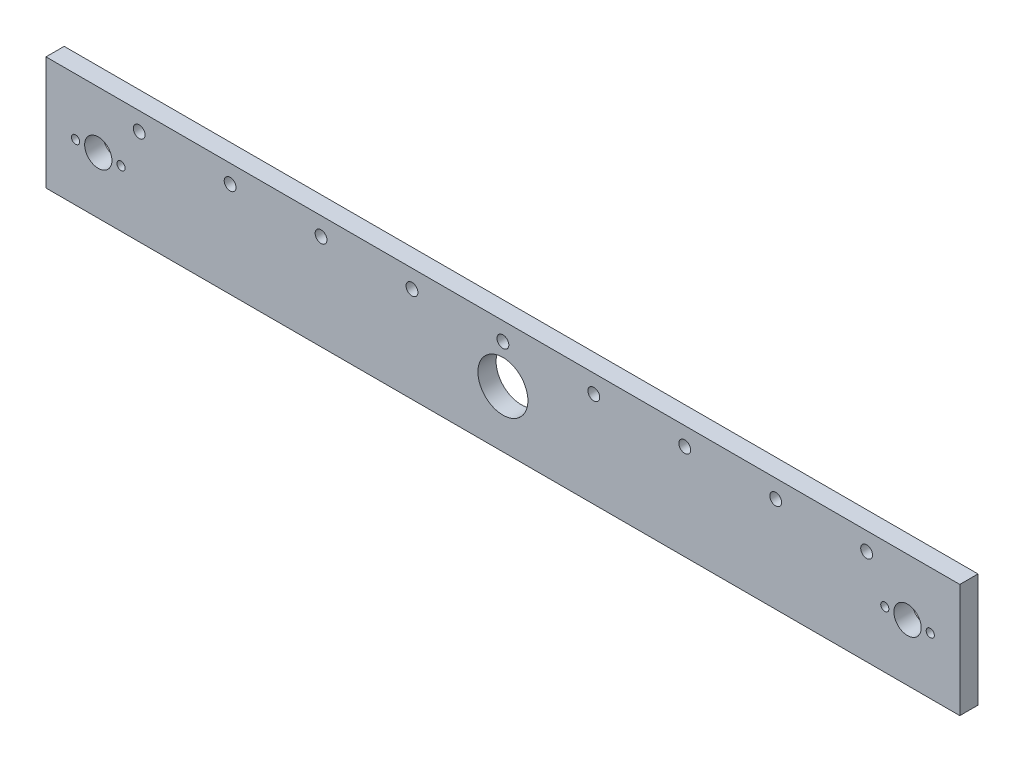
ISO-10303-21;
HEADER;
FILE_DESCRIPTION(('STEP AP214'),'2;1');
FILE_NAME('part.step','',(''),(''),'','','');
FILE_SCHEMA(('AUTOMOTIVE_DESIGN { 1 0 10303 214 1 1 1 1 }'));
ENDSEC;
DATA;
#1=APPLICATION_CONTEXT('core data for automotive mechanical design processes');
#2=APPLICATION_PROTOCOL_DEFINITION('international standard','automotive_design',2000,#1);
#3=PRODUCT_CONTEXT('',#1,'mechanical');
#4=PRODUCT('Part','Part','',(#3));
#5=PRODUCT_RELATED_PRODUCT_CATEGORY('part','',(#4));
#6=PRODUCT_DEFINITION_FORMATION('','',#4);
#7=PRODUCT_DEFINITION_CONTEXT('part definition',#1,'design');
#8=PRODUCT_DEFINITION('design','',#6,#7);
#9=PRODUCT_DEFINITION_SHAPE('','',#8);
#10=(LENGTH_UNIT() NAMED_UNIT(*) SI_UNIT(.MILLI.,.METRE.));
#11=(NAMED_UNIT(*) PLANE_ANGLE_UNIT() SI_UNIT($,.RADIAN.));
#12=(NAMED_UNIT(*) SI_UNIT($,.STERADIAN.) SOLID_ANGLE_UNIT());
#13=UNCERTAINTY_MEASURE_WITH_UNIT(LENGTH_MEASURE(1.E-05),#10,'distance_accuracy_value','');
#14=(GEOMETRIC_REPRESENTATION_CONTEXT(3) GLOBAL_UNCERTAINTY_ASSIGNED_CONTEXT((#13)) GLOBAL_UNIT_ASSIGNED_CONTEXT((#10,
#11,#12)) REPRESENTATION_CONTEXT('',''));
#15=CARTESIAN_POINT('',(0.,0.,0.));
#16=DIRECTION('',(0.,0.,1.));
#17=DIRECTION('',(1.,0.,0.));
#18=AXIS2_PLACEMENT_3D('',#15,#16,#17);
#19=CARTESIAN_POINT('',(0.,0.,8.));
#20=DIRECTION('',(0.,0.,-1.));
#21=DIRECTION('',(-1.,0.,0.));
#22=AXIS2_PLACEMENT_3D('',#19,#20,#21);
#23=PLANE('',#22);
#24=CARTESIAN_POINT('',(120.,17.,8.));
#25=DIRECTION('',(0.,0.,1.));
#26=DIRECTION('',(-1.,0.,0.));
#27=AXIS2_PLACEMENT_3D('',#24,#25,#26);
#28=CIRCLE('',#27,2.6);
#29=CARTESIAN_POINT('',(117.4,17.,8.));
#30=VERTEX_POINT('',#29);
#31=EDGE_CURVE('E193',#30,#30,#28,.T.);
#32=ORIENTED_EDGE('',*,*,#31,.F.);
#33=EDGE_LOOP('',(#32));
#34=FACE_BOUND('',#33,.T.);
#35=CARTESIAN_POINT('',(-160.,17.,8.));
#36=DIRECTION('',(0.,0.,1.));
#37=DIRECTION('',(1.,0.,0.));
#38=AXIS2_PLACEMENT_3D('',#35,#36,#37);
#39=CIRCLE('',#38,2.59999999999999);
#40=CARTESIAN_POINT('',(-157.4,17.,8.));
#41=VERTEX_POINT('',#40);
#42=EDGE_CURVE('E181',#41,#41,#39,.T.);
#43=ORIENTED_EDGE('',*,*,#42,.F.);
#44=EDGE_LOOP('',(#43));
#45=FACE_BOUND('',#44,.T.);
#46=CARTESIAN_POINT('',(-80.,17.,8.));
#47=DIRECTION('',(0.,0.,1.));
#48=DIRECTION('',(1.,0.,0.));
#49=AXIS2_PLACEMENT_3D('',#46,#47,#48);
#50=CIRCLE('',#49,2.6);
#51=CARTESIAN_POINT('',(-77.4,17.,8.));
#52=VERTEX_POINT('',#51);
#53=EDGE_CURVE('E169',#52,#52,#50,.T.);
#54=ORIENTED_EDGE('',*,*,#53,.F.);
#55=EDGE_LOOP('',(#54));
#56=FACE_BOUND('',#55,.T.);
#57=CARTESIAN_POINT('',(40.,17.,8.));
#58=DIRECTION('',(0.,0.,1.));
#59=DIRECTION('',(-1.,0.,0.));
#60=AXIS2_PLACEMENT_3D('',#57,#58,#59);
#61=CIRCLE('',#60,2.6);
#62=CARTESIAN_POINT('',(37.4,17.,8.));
#63=VERTEX_POINT('',#62);
#64=EDGE_CURVE('E157',#63,#63,#61,.T.);
#65=ORIENTED_EDGE('',*,*,#64,.F.);
#66=EDGE_LOOP('',(#65));
#67=FACE_BOUND('',#66,.T.);
#68=CARTESIAN_POINT('',(178.,0.,8.));
#69=DIRECTION('',(0.,0.,1.));
#70=DIRECTION('',(-1.,0.,0.));
#71=AXIS2_PLACEMENT_3D('',#68,#69,#70);
#72=CIRCLE('',#71,6.00000000000002);
#73=CARTESIAN_POINT('',(172.,0.,8.));
#74=VERTEX_POINT('',#73);
#75=EDGE_CURVE('E145',#74,#74,#72,.T.);
#76=ORIENTED_EDGE('',*,*,#75,.F.);
#77=EDGE_LOOP('',(#76));
#78=FACE_BOUND('',#77,.T.);
#79=CARTESIAN_POINT('',(-168.,0.,8.));
#80=DIRECTION('',(0.,0.,1.));
#81=DIRECTION('',(1.,0.,0.));
#82=AXIS2_PLACEMENT_3D('',#79,#80,#81);
#83=CIRCLE('',#82,1.80000000000001);
#84=CARTESIAN_POINT('',(-166.2,0.,8.));
#85=VERTEX_POINT('',#84);
#86=EDGE_CURVE('E133',#85,#85,#83,.T.);
#87=ORIENTED_EDGE('',*,*,#86,.F.);
#88=EDGE_LOOP('',(#87));
#89=FACE_BOUND('',#88,.T.);
#90=CARTESIAN_POINT('',(0.,0.,8.));
#91=DIRECTION('',(0.,0.,1.));
#92=DIRECTION('',(1.,0.,0.));
#93=AXIS2_PLACEMENT_3D('',#90,#91,#92);
#94=CIRCLE('',#93,11.);
#95=CARTESIAN_POINT('',(11.,0.,8.));
#96=VERTEX_POINT('',#95);
#97=EDGE_CURVE('E121',#96,#96,#94,.T.);
#98=ORIENTED_EDGE('',*,*,#97,.F.);
#99=EDGE_LOOP('',(#98));
#100=FACE_BOUND('',#99,.T.);
#101=CARTESIAN_POINT('',(-178.,0.,8.));
#102=DIRECTION('',(0.,0.,1.));
#103=DIRECTION('',(1.,0.,0.));
#104=AXIS2_PLACEMENT_3D('',#101,#102,#103);
#105=CIRCLE('',#104,5.99999999999999);
#106=CARTESIAN_POINT('',(-172.,0.,8.));
#107=VERTEX_POINT('',#106);
#108=EDGE_CURVE('E100',#107,#107,#105,.T.);
#109=ORIENTED_EDGE('',*,*,#108,.F.);
#110=EDGE_LOOP('',(#109));
#111=FACE_BOUND('',#110,.T.);
#112=DIRECTION('',(0.,1.,0.));
#113=VECTOR('',#112,1.);
#114=CARTESIAN_POINT('',(201.,-25.,8.));
#115=LINE('',#114,#113);
#116=CARTESIAN_POINT('',(201.,-25.,8.));
#117=VERTEX_POINT('',#116);
#118=CARTESIAN_POINT('',(201.,25.,8.));
#119=VERTEX_POINT('',#118);
#120=EDGE_CURVE('E85',#117,#119,#115,.T.);
#121=ORIENTED_EDGE('',*,*,#120,.T.);
#122=DIRECTION('',(-1.,0.,0.));
#123=VECTOR('',#122,1.);
#124=CARTESIAN_POINT('',(-201.,25.,8.));
#125=LINE('',#124,#123);
#126=CARTESIAN_POINT('',(-201.,25.,8.));
#127=VERTEX_POINT('',#126);
#128=EDGE_CURVE('E80',#119,#127,#125,.T.);
#129=ORIENTED_EDGE('',*,*,#128,.T.);
#130=DIRECTION('',(0.,-1.,0.));
#131=VECTOR('',#130,1.);
#132=CARTESIAN_POINT('',(-201.,-25.,8.));
#133=LINE('',#132,#131);
#134=CARTESIAN_POINT('',(-201.,-25.,8.));
#135=VERTEX_POINT('',#134);
#136=EDGE_CURVE('E83',#127,#135,#133,.T.);
#137=ORIENTED_EDGE('',*,*,#136,.T.);
#138=DIRECTION('',(1.,0.,0.));
#139=VECTOR('',#138,1.);
#140=CARTESIAN_POINT('',(-201.,-25.,8.));
#141=LINE('',#140,#139);
#142=EDGE_CURVE('E50',#135,#117,#141,.T.);
#143=ORIENTED_EDGE('',*,*,#142,.T.);
#144=EDGE_LOOP('',(#121,#129,#137,#143));
#145=FACE_BOUND('',#144,.T.);
#146=CARTESIAN_POINT('',(168.,0.,8.));
#147=DIRECTION('',(0.,0.,1.));
#148=DIRECTION('',(-1.,0.,0.));
#149=AXIS2_PLACEMENT_3D('',#146,#147,#148);
#150=CIRCLE('',#149,1.80000000000001);
#151=CARTESIAN_POINT('',(166.2,0.,8.));
#152=VERTEX_POINT('',#151);
#153=EDGE_CURVE('E115',#152,#152,#150,.T.);
#154=ORIENTED_EDGE('',*,*,#153,.F.);
#155=EDGE_LOOP('',(#154));
#156=FACE_BOUND('',#155,.T.);
#157=CARTESIAN_POINT('',(-188.,0.,8.));
#158=DIRECTION('',(0.,0.,1.));
#159=DIRECTION('',(1.,0.,0.));
#160=AXIS2_PLACEMENT_3D('',#157,#158,#159);
#161=CIRCLE('',#160,1.80000000000001);
#162=CARTESIAN_POINT('',(-186.2,0.,8.));
#163=VERTEX_POINT('',#162);
#164=EDGE_CURVE('E127',#163,#163,#161,.T.);
#165=ORIENTED_EDGE('',*,*,#164,.F.);
#166=EDGE_LOOP('',(#165));
#167=FACE_BOUND('',#166,.T.);
#168=CARTESIAN_POINT('',(188.,0.,8.));
#169=DIRECTION('',(0.,0.,1.));
#170=DIRECTION('',(-1.,0.,0.));
#171=AXIS2_PLACEMENT_3D('',#168,#169,#170);
#172=CIRCLE('',#171,1.80000000000001);
#173=CARTESIAN_POINT('',(186.2,0.,8.));
#174=VERTEX_POINT('',#173);
#175=EDGE_CURVE('E139',#174,#174,#172,.T.);
#176=ORIENTED_EDGE('',*,*,#175,.F.);
#177=EDGE_LOOP('',(#176));
#178=FACE_BOUND('',#177,.T.);
#179=CARTESIAN_POINT('',(0.,17.,8.));
#180=DIRECTION('',(0.,0.,1.));
#181=DIRECTION('',(1.,0.,0.));
#182=AXIS2_PLACEMENT_3D('',#179,#180,#181);
#183=CIRCLE('',#182,2.6);
#184=CARTESIAN_POINT('',(2.6,17.,8.));
#185=VERTEX_POINT('',#184);
#186=EDGE_CURVE('E151',#185,#185,#183,.T.);
#187=ORIENTED_EDGE('',*,*,#186,.F.);
#188=EDGE_LOOP('',(#187));
#189=FACE_BOUND('',#188,.T.);
#190=CARTESIAN_POINT('',(-40.,17.,8.));
#191=DIRECTION('',(0.,0.,1.));
#192=DIRECTION('',(1.,0.,0.));
#193=AXIS2_PLACEMENT_3D('',#190,#191,#192);
#194=CIRCLE('',#193,2.6);
#195=CARTESIAN_POINT('',(-37.4,17.,8.));
#196=VERTEX_POINT('',#195);
#197=EDGE_CURVE('E163',#196,#196,#194,.T.);
#198=ORIENTED_EDGE('',*,*,#197,.F.);
#199=EDGE_LOOP('',(#198));
#200=FACE_BOUND('',#199,.T.);
#201=CARTESIAN_POINT('',(-120.,17.,8.));
#202=DIRECTION('',(0.,0.,1.));
#203=DIRECTION('',(1.,0.,0.));
#204=AXIS2_PLACEMENT_3D('',#201,#202,#203);
#205=CIRCLE('',#204,2.6);
#206=CARTESIAN_POINT('',(-117.4,17.,8.));
#207=VERTEX_POINT('',#206);
#208=EDGE_CURVE('E175',#207,#207,#205,.T.);
#209=ORIENTED_EDGE('',*,*,#208,.F.);
#210=EDGE_LOOP('',(#209));
#211=FACE_BOUND('',#210,.T.);
#212=CARTESIAN_POINT('',(80.,17.,8.));
#213=DIRECTION('',(0.,0.,1.));
#214=DIRECTION('',(-1.,0.,0.));
#215=AXIS2_PLACEMENT_3D('',#212,#213,#214);
#216=CIRCLE('',#215,2.6);
#217=CARTESIAN_POINT('',(77.4,17.,8.));
#218=VERTEX_POINT('',#217);
#219=EDGE_CURVE('E187',#218,#218,#216,.T.);
#220=ORIENTED_EDGE('',*,*,#219,.F.);
#221=EDGE_LOOP('',(#220));
#222=FACE_BOUND('',#221,.T.);
#223=CARTESIAN_POINT('',(160.,17.,8.));
#224=DIRECTION('',(0.,0.,1.));
#225=DIRECTION('',(-1.,0.,0.));
#226=AXIS2_PLACEMENT_3D('',#223,#224,#225);
#227=CIRCLE('',#226,2.59999999999999);
#228=CARTESIAN_POINT('',(157.4,17.,8.));
#229=VERTEX_POINT('',#228);
#230=EDGE_CURVE('E199',#229,#229,#227,.T.);
#231=ORIENTED_EDGE('',*,*,#230,.F.);
#232=EDGE_LOOP('',(#231));
#233=FACE_BOUND('',#232,.T.);
#234=ADVANCED_FACE('F33',(#34,#45,#56,#67,#78,#89,#100,#111,#145,#156,#167,#178,#189,#200,#211,
#222,#233),#23,.F.);
#235=CARTESIAN_POINT('',(0.,0.,0.));
#236=DIRECTION('',(0.,0.,-1.));
#237=DIRECTION('',(-1.,0.,0.));
#238=AXIS2_PLACEMENT_3D('',#235,#236,#237);
#239=PLANE('',#238);
#240=CARTESIAN_POINT('',(120.,17.,0.));
#241=DIRECTION('',(0.,0.,1.));
#242=DIRECTION('',(-1.,0.,0.));
#243=AXIS2_PLACEMENT_3D('',#240,#241,#242);
#244=CIRCLE('',#243,2.6);
#245=CARTESIAN_POINT('',(117.4,17.,0.));
#246=VERTEX_POINT('',#245);
#247=EDGE_CURVE('E196',#246,#246,#244,.T.);
#248=ORIENTED_EDGE('',*,*,#247,.T.);
#249=EDGE_LOOP('',(#248));
#250=FACE_BOUND('',#249,.T.);
#251=CARTESIAN_POINT('',(-160.,17.,0.));
#252=DIRECTION('',(0.,0.,1.));
#253=DIRECTION('',(1.,0.,0.));
#254=AXIS2_PLACEMENT_3D('',#251,#252,#253);
#255=CIRCLE('',#254,2.59999999999999);
#256=CARTESIAN_POINT('',(-157.4,17.,0.));
#257=VERTEX_POINT('',#256);
#258=EDGE_CURVE('E184',#257,#257,#255,.T.);
#259=ORIENTED_EDGE('',*,*,#258,.T.);
#260=EDGE_LOOP('',(#259));
#261=FACE_BOUND('',#260,.T.);
#262=CARTESIAN_POINT('',(-80.,17.,0.));
#263=DIRECTION('',(0.,0.,1.));
#264=DIRECTION('',(1.,0.,0.));
#265=AXIS2_PLACEMENT_3D('',#262,#263,#264);
#266=CIRCLE('',#265,2.6);
#267=CARTESIAN_POINT('',(-77.4,17.,0.));
#268=VERTEX_POINT('',#267);
#269=EDGE_CURVE('E172',#268,#268,#266,.T.);
#270=ORIENTED_EDGE('',*,*,#269,.T.);
#271=EDGE_LOOP('',(#270));
#272=FACE_BOUND('',#271,.T.);
#273=CARTESIAN_POINT('',(40.,17.,0.));
#274=DIRECTION('',(0.,0.,1.));
#275=DIRECTION('',(-1.,0.,0.));
#276=AXIS2_PLACEMENT_3D('',#273,#274,#275);
#277=CIRCLE('',#276,2.6);
#278=CARTESIAN_POINT('',(37.4,17.,0.));
#279=VERTEX_POINT('',#278);
#280=EDGE_CURVE('E160',#279,#279,#277,.T.);
#281=ORIENTED_EDGE('',*,*,#280,.T.);
#282=EDGE_LOOP('',(#281));
#283=FACE_BOUND('',#282,.T.);
#284=CARTESIAN_POINT('',(178.,0.,0.));
#285=DIRECTION('',(0.,0.,1.));
#286=DIRECTION('',(-1.,0.,0.));
#287=AXIS2_PLACEMENT_3D('',#284,#285,#286);
#288=CIRCLE('',#287,6.00000000000002);
#289=CARTESIAN_POINT('',(172.,0.,0.));
#290=VERTEX_POINT('',#289);
#291=EDGE_CURVE('E148',#290,#290,#288,.T.);
#292=ORIENTED_EDGE('',*,*,#291,.T.);
#293=EDGE_LOOP('',(#292));
#294=FACE_BOUND('',#293,.T.);
#295=CARTESIAN_POINT('',(-168.,0.,0.));
#296=DIRECTION('',(0.,0.,1.));
#297=DIRECTION('',(1.,0.,0.));
#298=AXIS2_PLACEMENT_3D('',#295,#296,#297);
#299=CIRCLE('',#298,1.80000000000001);
#300=CARTESIAN_POINT('',(-166.2,0.,0.));
#301=VERTEX_POINT('',#300);
#302=EDGE_CURVE('E136',#301,#301,#299,.T.);
#303=ORIENTED_EDGE('',*,*,#302,.T.);
#304=EDGE_LOOP('',(#303));
#305=FACE_BOUND('',#304,.T.);
#306=CARTESIAN_POINT('',(0.,0.,0.));
#307=DIRECTION('',(0.,0.,1.));
#308=DIRECTION('',(1.,0.,0.));
#309=AXIS2_PLACEMENT_3D('',#306,#307,#308);
#310=CIRCLE('',#309,11.);
#311=CARTESIAN_POINT('',(11.,0.,0.));
#312=VERTEX_POINT('',#311);
#313=EDGE_CURVE('E124',#312,#312,#310,.T.);
#314=ORIENTED_EDGE('',*,*,#313,.T.);
#315=EDGE_LOOP('',(#314));
#316=FACE_BOUND('',#315,.T.);
#317=CARTESIAN_POINT('',(-178.,0.,0.));
#318=DIRECTION('',(0.,0.,1.));
#319=DIRECTION('',(1.,0.,0.));
#320=AXIS2_PLACEMENT_3D('',#317,#318,#319);
#321=CIRCLE('',#320,5.99999999999999);
#322=CARTESIAN_POINT('',(-172.,0.,0.));
#323=VERTEX_POINT('',#322);
#324=EDGE_CURVE('E112',#323,#323,#321,.T.);
#325=ORIENTED_EDGE('',*,*,#324,.T.);
#326=EDGE_LOOP('',(#325));
#327=FACE_BOUND('',#326,.T.);
#328=DIRECTION('',(0.,1.,0.));
#329=VECTOR('',#328,1.);
#330=CARTESIAN_POINT('',(201.,-25.,0.));
#331=LINE('',#330,#329);
#332=CARTESIAN_POINT('',(201.,-25.,0.));
#333=VERTEX_POINT('',#332);
#334=CARTESIAN_POINT('',(201.,25.,0.));
#335=VERTEX_POINT('',#334);
#336=EDGE_CURVE('E97',#333,#335,#331,.T.);
#337=ORIENTED_EDGE('',*,*,#336,.F.);
#338=DIRECTION('',(1.,0.,0.));
#339=VECTOR('',#338,1.);
#340=CARTESIAN_POINT('',(-201.,-25.,0.));
#341=LINE('',#340,#339);
#342=CARTESIAN_POINT('',(-201.,-25.,0.));
#343=VERTEX_POINT('',#342);
#344=EDGE_CURVE('E73',#343,#333,#341,.T.);
#345=ORIENTED_EDGE('',*,*,#344,.F.);
#346=DIRECTION('',(0.,-1.,0.));
#347=VECTOR('',#346,1.);
#348=CARTESIAN_POINT('',(-201.,-25.,0.));
#349=LINE('',#348,#347);
#350=CARTESIAN_POINT('',(-201.,25.,0.));
#351=VERTEX_POINT('',#350);
#352=EDGE_CURVE('E67',#351,#343,#349,.T.);
#353=ORIENTED_EDGE('',*,*,#352,.F.);
#354=DIRECTION('',(-1.,0.,0.));
#355=VECTOR('',#354,1.);
#356=CARTESIAN_POINT('',(-201.,25.,0.));
#357=LINE('',#356,#355);
#358=EDGE_CURVE('E89',#335,#351,#357,.T.);
#359=ORIENTED_EDGE('',*,*,#358,.F.);
#360=EDGE_LOOP('',(#337,#345,#353,#359));
#361=FACE_BOUND('',#360,.T.);
#362=CARTESIAN_POINT('',(168.,0.,0.));
#363=DIRECTION('',(0.,0.,1.));
#364=DIRECTION('',(-1.,0.,0.));
#365=AXIS2_PLACEMENT_3D('',#362,#363,#364);
#366=CIRCLE('',#365,1.80000000000001);
#367=CARTESIAN_POINT('',(166.2,0.,0.));
#368=VERTEX_POINT('',#367);
#369=EDGE_CURVE('E118',#368,#368,#366,.T.);
#370=ORIENTED_EDGE('',*,*,#369,.T.);
#371=EDGE_LOOP('',(#370));
#372=FACE_BOUND('',#371,.T.);
#373=CARTESIAN_POINT('',(-188.,0.,0.));
#374=DIRECTION('',(0.,0.,1.));
#375=DIRECTION('',(1.,0.,0.));
#376=AXIS2_PLACEMENT_3D('',#373,#374,#375);
#377=CIRCLE('',#376,1.80000000000001);
#378=CARTESIAN_POINT('',(-186.2,0.,0.));
#379=VERTEX_POINT('',#378);
#380=EDGE_CURVE('E130',#379,#379,#377,.T.);
#381=ORIENTED_EDGE('',*,*,#380,.T.);
#382=EDGE_LOOP('',(#381));
#383=FACE_BOUND('',#382,.T.);
#384=CARTESIAN_POINT('',(188.,0.,0.));
#385=DIRECTION('',(0.,0.,1.));
#386=DIRECTION('',(-1.,0.,0.));
#387=AXIS2_PLACEMENT_3D('',#384,#385,#386);
#388=CIRCLE('',#387,1.80000000000001);
#389=CARTESIAN_POINT('',(186.2,0.,0.));
#390=VERTEX_POINT('',#389);
#391=EDGE_CURVE('E142',#390,#390,#388,.T.);
#392=ORIENTED_EDGE('',*,*,#391,.T.);
#393=EDGE_LOOP('',(#392));
#394=FACE_BOUND('',#393,.T.);
#395=CARTESIAN_POINT('',(0.,17.,0.));
#396=DIRECTION('',(0.,0.,1.));
#397=DIRECTION('',(1.,0.,0.));
#398=AXIS2_PLACEMENT_3D('',#395,#396,#397);
#399=CIRCLE('',#398,2.6);
#400=CARTESIAN_POINT('',(2.6,17.,0.));
#401=VERTEX_POINT('',#400);
#402=EDGE_CURVE('E154',#401,#401,#399,.T.);
#403=ORIENTED_EDGE('',*,*,#402,.T.);
#404=EDGE_LOOP('',(#403));
#405=FACE_BOUND('',#404,.T.);
#406=CARTESIAN_POINT('',(-40.,17.,0.));
#407=DIRECTION('',(0.,0.,1.));
#408=DIRECTION('',(1.,0.,0.));
#409=AXIS2_PLACEMENT_3D('',#406,#407,#408);
#410=CIRCLE('',#409,2.6);
#411=CARTESIAN_POINT('',(-37.4,17.,0.));
#412=VERTEX_POINT('',#411);
#413=EDGE_CURVE('E166',#412,#412,#410,.T.);
#414=ORIENTED_EDGE('',*,*,#413,.T.);
#415=EDGE_LOOP('',(#414));
#416=FACE_BOUND('',#415,.T.);
#417=CARTESIAN_POINT('',(-120.,17.,0.));
#418=DIRECTION('',(0.,0.,1.));
#419=DIRECTION('',(1.,0.,0.));
#420=AXIS2_PLACEMENT_3D('',#417,#418,#419);
#421=CIRCLE('',#420,2.6);
#422=CARTESIAN_POINT('',(-117.4,17.,0.));
#423=VERTEX_POINT('',#422);
#424=EDGE_CURVE('E178',#423,#423,#421,.T.);
#425=ORIENTED_EDGE('',*,*,#424,.T.);
#426=EDGE_LOOP('',(#425));
#427=FACE_BOUND('',#426,.T.);
#428=CARTESIAN_POINT('',(80.,17.,0.));
#429=DIRECTION('',(0.,0.,1.));
#430=DIRECTION('',(-1.,0.,0.));
#431=AXIS2_PLACEMENT_3D('',#428,#429,#430);
#432=CIRCLE('',#431,2.6);
#433=CARTESIAN_POINT('',(77.4,17.,0.));
#434=VERTEX_POINT('',#433);
#435=EDGE_CURVE('E190',#434,#434,#432,.T.);
#436=ORIENTED_EDGE('',*,*,#435,.T.);
#437=EDGE_LOOP('',(#436));
#438=FACE_BOUND('',#437,.T.);
#439=CARTESIAN_POINT('',(160.,17.,0.));
#440=DIRECTION('',(0.,0.,1.));
#441=DIRECTION('',(-1.,0.,0.));
#442=AXIS2_PLACEMENT_3D('',#439,#440,#441);
#443=CIRCLE('',#442,2.59999999999999);
#444=CARTESIAN_POINT('',(157.4,17.,0.));
#445=VERTEX_POINT('',#444);
#446=EDGE_CURVE('E202',#445,#445,#443,.T.);
#447=ORIENTED_EDGE('',*,*,#446,.T.);
#448=EDGE_LOOP('',(#447));
#449=FACE_BOUND('',#448,.T.);
#450=ADVANCED_FACE('F108',(#250,#261,#272,#283,#294,#305,#316,#327,#361,#372,#383,#394,#405,
#416,#427,#438,#449),#239,.T.);
#451=CARTESIAN_POINT('',(201.,-25.,8.));
#452=DIRECTION('',(-1.,0.,0.));
#453=DIRECTION('',(0.,0.,1.));
#454=AXIS2_PLACEMENT_3D('',#451,#452,#453);
#455=PLANE('',#454);
#456=ORIENTED_EDGE('',*,*,#336,.T.);
#457=DIRECTION('',(0.,0.,-1.));
#458=VECTOR('',#457,1.);
#459=CARTESIAN_POINT('',(201.,25.,8.));
#460=LINE('',#459,#458);
#461=EDGE_CURVE('E11',#119,#335,#460,.T.);
#462=ORIENTED_EDGE('',*,*,#461,.F.);
#463=ORIENTED_EDGE('',*,*,#120,.F.);
#464=DIRECTION('',(0.,0.,-1.));
#465=VECTOR('',#464,1.);
#466=CARTESIAN_POINT('',(201.,-25.,8.));
#467=LINE('',#466,#465);
#468=EDGE_CURVE('E93',#117,#333,#467,.T.);
#469=ORIENTED_EDGE('',*,*,#468,.T.);
#470=EDGE_LOOP('',(#456,#462,#463,#469));
#471=FACE_BOUND('',#470,.T.);
#472=ADVANCED_FACE('F35',(#471),#455,.F.);
#473=CARTESIAN_POINT('',(-201.,25.,8.));
#474=DIRECTION('',(0.,-1.,0.));
#475=DIRECTION('',(0.,0.,-1.));
#476=AXIS2_PLACEMENT_3D('',#473,#474,#475);
#477=PLANE('',#476);
#478=ORIENTED_EDGE('',*,*,#358,.T.);
#479=DIRECTION('',(0.,0.,-1.));
#480=VECTOR('',#479,1.);
#481=CARTESIAN_POINT('',(-201.,25.,8.));
#482=LINE('',#481,#480);
#483=EDGE_CURVE('E42',#127,#351,#482,.T.);
#484=ORIENTED_EDGE('',*,*,#483,.F.);
#485=ORIENTED_EDGE('',*,*,#128,.F.);
#486=ORIENTED_EDGE('',*,*,#461,.T.);
#487=EDGE_LOOP('',(#478,#484,#485,#486));
#488=FACE_BOUND('',#487,.T.);
#489=ADVANCED_FACE('F88',(#488),#477,.F.);
#490=CARTESIAN_POINT('',(-201.,-25.,8.));
#491=DIRECTION('',(1.,0.,0.));
#492=DIRECTION('',(0.,0.,-1.));
#493=AXIS2_PLACEMENT_3D('',#490,#491,#492);
#494=PLANE('',#493);
#495=ORIENTED_EDGE('',*,*,#352,.T.);
#496=DIRECTION('',(0.,0.,-1.));
#497=VECTOR('',#496,1.);
#498=CARTESIAN_POINT('',(-201.,-25.,8.));
#499=LINE('',#498,#497);
#500=EDGE_CURVE('E90',#135,#343,#499,.T.);
#501=ORIENTED_EDGE('',*,*,#500,.F.);
#502=ORIENTED_EDGE('',*,*,#136,.F.);
#503=ORIENTED_EDGE('',*,*,#483,.T.);
#504=EDGE_LOOP('',(#495,#501,#502,#503));
#505=FACE_BOUND('',#504,.T.);
#506=ADVANCED_FACE('F91',(#505),#494,.F.);
#507=CARTESIAN_POINT('',(-201.,-25.,8.));
#508=DIRECTION('',(0.,1.,0.));
#509=DIRECTION('',(0.,0.,1.));
#510=AXIS2_PLACEMENT_3D('',#507,#508,#509);
#511=PLANE('',#510);
#512=ORIENTED_EDGE('',*,*,#344,.T.);
#513=ORIENTED_EDGE('',*,*,#468,.F.);
#514=ORIENTED_EDGE('',*,*,#142,.F.);
#515=ORIENTED_EDGE('',*,*,#500,.T.);
#516=EDGE_LOOP('',(#512,#513,#514,#515));
#517=FACE_BOUND('',#516,.T.);
#518=ADVANCED_FACE('F105',(#517),#511,.F.);
#519=CARTESIAN_POINT('',(-178.,0.,8.));
#520=DIRECTION('',(0.,0.,-1.));
#521=DIRECTION('',(-1.,0.,0.));
#522=AXIS2_PLACEMENT_3D('',#519,#520,#521);
#523=CYLINDRICAL_SURFACE('',#522,5.99999999999999);
#524=ORIENTED_EDGE('',*,*,#108,.T.);
#525=EDGE_LOOP('',(#524));
#526=FACE_BOUND('',#525,.T.);
#527=ORIENTED_EDGE('',*,*,#324,.F.);
#528=EDGE_LOOP('',(#527));
#529=FACE_BOUND('',#528,.T.);
#530=ADVANCED_FACE('F222',(#526,#529),#523,.F.);
#531=CARTESIAN_POINT('',(168.,0.,8.));
#532=DIRECTION('',(0.,0.,-1.));
#533=DIRECTION('',(-1.,0.,0.));
#534=AXIS2_PLACEMENT_3D('',#531,#532,#533);
#535=CYLINDRICAL_SURFACE('',#534,1.80000000000001);
#536=ORIENTED_EDGE('',*,*,#153,.T.);
#537=EDGE_LOOP('',(#536));
#538=FACE_BOUND('',#537,.T.);
#539=ORIENTED_EDGE('',*,*,#369,.F.);
#540=EDGE_LOOP('',(#539));
#541=FACE_BOUND('',#540,.T.);
#542=ADVANCED_FACE('F268',(#538,#541),#535,.F.);
#543=CARTESIAN_POINT('',(0.,0.,8.));
#544=DIRECTION('',(0.,0.,-1.));
#545=DIRECTION('',(-1.,0.,0.));
#546=AXIS2_PLACEMENT_3D('',#543,#544,#545);
#547=CYLINDRICAL_SURFACE('',#546,11.);
#548=ORIENTED_EDGE('',*,*,#97,.T.);
#549=EDGE_LOOP('',(#548));
#550=FACE_BOUND('',#549,.T.);
#551=ORIENTED_EDGE('',*,*,#313,.F.);
#552=EDGE_LOOP('',(#551));
#553=FACE_BOUND('',#552,.T.);
#554=ADVANCED_FACE('F276',(#550,#553),#547,.F.);
#555=CARTESIAN_POINT('',(-188.,0.,8.));
#556=DIRECTION('',(0.,0.,-1.));
#557=DIRECTION('',(-1.,0.,0.));
#558=AXIS2_PLACEMENT_3D('',#555,#556,#557);
#559=CYLINDRICAL_SURFACE('',#558,1.80000000000001);
#560=ORIENTED_EDGE('',*,*,#164,.T.);
#561=EDGE_LOOP('',(#560));
#562=FACE_BOUND('',#561,.T.);
#563=ORIENTED_EDGE('',*,*,#380,.F.);
#564=EDGE_LOOP('',(#563));
#565=FACE_BOUND('',#564,.T.);
#566=ADVANCED_FACE('F284',(#562,#565),#559,.F.);
#567=CARTESIAN_POINT('',(-168.,0.,8.));
#568=DIRECTION('',(0.,0.,-1.));
#569=DIRECTION('',(-1.,0.,0.));
#570=AXIS2_PLACEMENT_3D('',#567,#568,#569);
#571=CYLINDRICAL_SURFACE('',#570,1.80000000000001);
#572=ORIENTED_EDGE('',*,*,#86,.T.);
#573=EDGE_LOOP('',(#572));
#574=FACE_BOUND('',#573,.T.);
#575=ORIENTED_EDGE('',*,*,#302,.F.);
#576=EDGE_LOOP('',(#575));
#577=FACE_BOUND('',#576,.T.);
#578=ADVANCED_FACE('F293',(#574,#577),#571,.F.);
#579=CARTESIAN_POINT('',(188.,0.,8.));
#580=DIRECTION('',(0.,0.,-1.));
#581=DIRECTION('',(-1.,0.,0.));
#582=AXIS2_PLACEMENT_3D('',#579,#580,#581);
#583=CYLINDRICAL_SURFACE('',#582,1.80000000000001);
#584=ORIENTED_EDGE('',*,*,#175,.T.);
#585=EDGE_LOOP('',(#584));
#586=FACE_BOUND('',#585,.T.);
#587=ORIENTED_EDGE('',*,*,#391,.F.);
#588=EDGE_LOOP('',(#587));
#589=FACE_BOUND('',#588,.T.);
#590=ADVANCED_FACE('F302',(#586,#589),#583,.F.);
#591=CARTESIAN_POINT('',(178.,0.,8.));
#592=DIRECTION('',(0.,0.,-1.));
#593=DIRECTION('',(-1.,0.,0.));
#594=AXIS2_PLACEMENT_3D('',#591,#592,#593);
#595=CYLINDRICAL_SURFACE('',#594,6.00000000000002);
#596=ORIENTED_EDGE('',*,*,#75,.T.);
#597=EDGE_LOOP('',(#596));
#598=FACE_BOUND('',#597,.T.);
#599=ORIENTED_EDGE('',*,*,#291,.F.);
#600=EDGE_LOOP('',(#599));
#601=FACE_BOUND('',#600,.T.);
#602=ADVANCED_FACE('F311',(#598,#601),#595,.F.);
#603=CARTESIAN_POINT('',(0.,17.,8.));
#604=DIRECTION('',(0.,0.,-1.));
#605=DIRECTION('',(-1.,0.,0.));
#606=AXIS2_PLACEMENT_3D('',#603,#604,#605);
#607=CYLINDRICAL_SURFACE('',#606,2.6);
#608=ORIENTED_EDGE('',*,*,#186,.T.);
#609=EDGE_LOOP('',(#608));
#610=FACE_BOUND('',#609,.T.);
#611=ORIENTED_EDGE('',*,*,#402,.F.);
#612=EDGE_LOOP('',(#611));
#613=FACE_BOUND('',#612,.T.);
#614=ADVANCED_FACE('F320',(#610,#613),#607,.F.);
#615=CARTESIAN_POINT('',(40.,17.,8.));
#616=DIRECTION('',(0.,0.,-1.));
#617=DIRECTION('',(-1.,0.,0.));
#618=AXIS2_PLACEMENT_3D('',#615,#616,#617);
#619=CYLINDRICAL_SURFACE('',#618,2.6);
#620=ORIENTED_EDGE('',*,*,#64,.T.);
#621=EDGE_LOOP('',(#620));
#622=FACE_BOUND('',#621,.T.);
#623=ORIENTED_EDGE('',*,*,#280,.F.);
#624=EDGE_LOOP('',(#623));
#625=FACE_BOUND('',#624,.T.);
#626=ADVANCED_FACE('F329',(#622,#625),#619,.F.);
#627=CARTESIAN_POINT('',(-40.,17.,8.));
#628=DIRECTION('',(0.,0.,-1.));
#629=DIRECTION('',(-1.,0.,0.));
#630=AXIS2_PLACEMENT_3D('',#627,#628,#629);
#631=CYLINDRICAL_SURFACE('',#630,2.6);
#632=ORIENTED_EDGE('',*,*,#197,.T.);
#633=EDGE_LOOP('',(#632));
#634=FACE_BOUND('',#633,.T.);
#635=ORIENTED_EDGE('',*,*,#413,.F.);
#636=EDGE_LOOP('',(#635));
#637=FACE_BOUND('',#636,.T.);
#638=ADVANCED_FACE('F338',(#634,#637),#631,.F.);
#639=CARTESIAN_POINT('',(-80.,17.,8.));
#640=DIRECTION('',(0.,0.,-1.));
#641=DIRECTION('',(-1.,0.,0.));
#642=AXIS2_PLACEMENT_3D('',#639,#640,#641);
#643=CYLINDRICAL_SURFACE('',#642,2.6);
#644=ORIENTED_EDGE('',*,*,#53,.T.);
#645=EDGE_LOOP('',(#644));
#646=FACE_BOUND('',#645,.T.);
#647=ORIENTED_EDGE('',*,*,#269,.F.);
#648=EDGE_LOOP('',(#647));
#649=FACE_BOUND('',#648,.T.);
#650=ADVANCED_FACE('F347',(#646,#649),#643,.F.);
#651=CARTESIAN_POINT('',(-120.,17.,8.));
#652=DIRECTION('',(0.,0.,-1.));
#653=DIRECTION('',(-1.,0.,0.));
#654=AXIS2_PLACEMENT_3D('',#651,#652,#653);
#655=CYLINDRICAL_SURFACE('',#654,2.6);
#656=ORIENTED_EDGE('',*,*,#208,.T.);
#657=EDGE_LOOP('',(#656));
#658=FACE_BOUND('',#657,.T.);
#659=ORIENTED_EDGE('',*,*,#424,.F.);
#660=EDGE_LOOP('',(#659));
#661=FACE_BOUND('',#660,.T.);
#662=ADVANCED_FACE('F356',(#658,#661),#655,.F.);
#663=CARTESIAN_POINT('',(-160.,17.,8.));
#664=DIRECTION('',(0.,0.,-1.));
#665=DIRECTION('',(-1.,0.,0.));
#666=AXIS2_PLACEMENT_3D('',#663,#664,#665);
#667=CYLINDRICAL_SURFACE('',#666,2.59999999999999);
#668=ORIENTED_EDGE('',*,*,#42,.T.);
#669=EDGE_LOOP('',(#668));
#670=FACE_BOUND('',#669,.T.);
#671=ORIENTED_EDGE('',*,*,#258,.F.);
#672=EDGE_LOOP('',(#671));
#673=FACE_BOUND('',#672,.T.);
#674=ADVANCED_FACE('F365',(#670,#673),#667,.F.);
#675=CARTESIAN_POINT('',(80.,17.,8.));
#676=DIRECTION('',(0.,0.,-1.));
#677=DIRECTION('',(-1.,0.,0.));
#678=AXIS2_PLACEMENT_3D('',#675,#676,#677);
#679=CYLINDRICAL_SURFACE('',#678,2.6);
#680=ORIENTED_EDGE('',*,*,#219,.T.);
#681=EDGE_LOOP('',(#680));
#682=FACE_BOUND('',#681,.T.);
#683=ORIENTED_EDGE('',*,*,#435,.F.);
#684=EDGE_LOOP('',(#683));
#685=FACE_BOUND('',#684,.T.);
#686=ADVANCED_FACE('F374',(#682,#685),#679,.F.);
#687=CARTESIAN_POINT('',(120.,17.,8.));
#688=DIRECTION('',(0.,0.,-1.));
#689=DIRECTION('',(-1.,0.,0.));
#690=AXIS2_PLACEMENT_3D('',#687,#688,#689);
#691=CYLINDRICAL_SURFACE('',#690,2.6);
#692=ORIENTED_EDGE('',*,*,#31,.T.);
#693=EDGE_LOOP('',(#692));
#694=FACE_BOUND('',#693,.T.);
#695=ORIENTED_EDGE('',*,*,#247,.F.);
#696=EDGE_LOOP('',(#695));
#697=FACE_BOUND('',#696,.T.);
#698=ADVANCED_FACE('F383',(#694,#697),#691,.F.);
#699=CARTESIAN_POINT('',(160.,17.,8.));
#700=DIRECTION('',(0.,0.,-1.));
#701=DIRECTION('',(-1.,0.,0.));
#702=AXIS2_PLACEMENT_3D('',#699,#700,#701);
#703=CYLINDRICAL_SURFACE('',#702,2.59999999999999);
#704=ORIENTED_EDGE('',*,*,#230,.T.);
#705=EDGE_LOOP('',(#704));
#706=FACE_BOUND('',#705,.T.);
#707=ORIENTED_EDGE('',*,*,#446,.F.);
#708=EDGE_LOOP('',(#707));
#709=FACE_BOUND('',#708,.T.);
#710=ADVANCED_FACE('F208',(#706,#709),#703,.F.);
#711=CLOSED_SHELL('',(#234,#450,#472,#489,#506,#518,#530,#542,#554,#566,#578,#590,#602,#614,
#626,#638,#650,#662,#674,#686,#698,#710));
#712=MANIFOLD_SOLID_BREP('B2',#711);
#713=ADVANCED_BREP_SHAPE_REPRESENTATION('',(#18,#712),#14);
#714=SHAPE_DEFINITION_REPRESENTATION(#9,#713);
ENDSEC;
END-ISO-10303-21;
